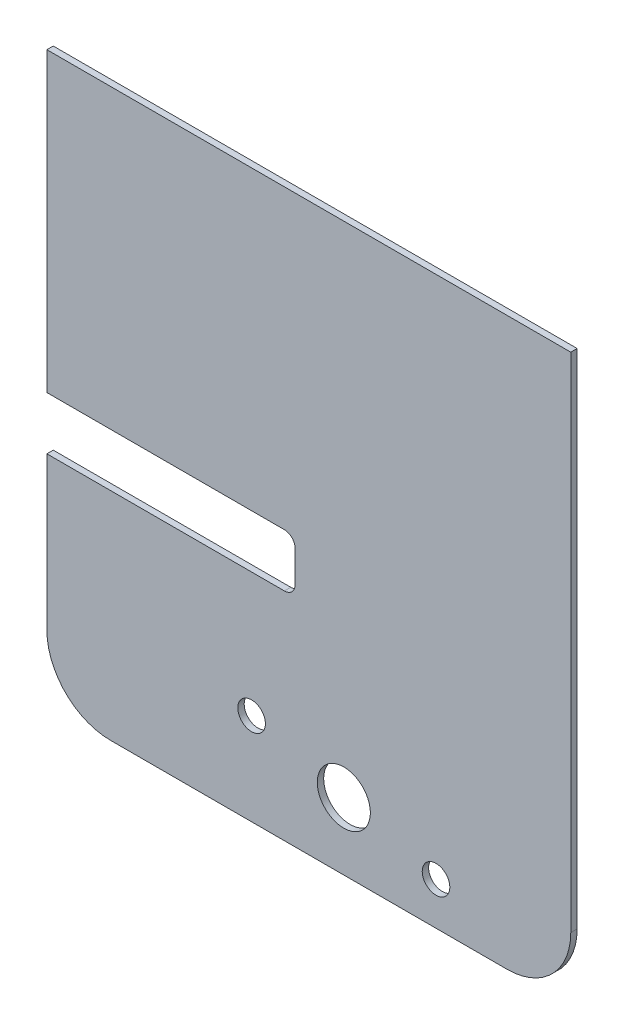
ISO-10303-21;
HEADER;
FILE_DESCRIPTION(('STEP AP214'),'2;1');
FILE_NAME('part.step','',(''),(''),'','','');
FILE_SCHEMA(('AUTOMOTIVE_DESIGN { 1 0 10303 214 1 1 1 1 }'));
ENDSEC;
DATA;
#1=APPLICATION_CONTEXT('core data for automotive mechanical design processes');
#2=APPLICATION_PROTOCOL_DEFINITION('international standard','automotive_design',2000,#1);
#3=PRODUCT_CONTEXT('',#1,'mechanical');
#4=PRODUCT('Part','Part','',(#3));
#5=PRODUCT_RELATED_PRODUCT_CATEGORY('part','',(#4));
#6=PRODUCT_DEFINITION_FORMATION('','',#4);
#7=PRODUCT_DEFINITION_CONTEXT('part definition',#1,'design');
#8=PRODUCT_DEFINITION('design','',#6,#7);
#9=PRODUCT_DEFINITION_SHAPE('','',#8);
#10=(LENGTH_UNIT() NAMED_UNIT(*) SI_UNIT(.MILLI.,.METRE.));
#11=(NAMED_UNIT(*) PLANE_ANGLE_UNIT() SI_UNIT($,.RADIAN.));
#12=(NAMED_UNIT(*) SI_UNIT($,.STERADIAN.) SOLID_ANGLE_UNIT());
#13=UNCERTAINTY_MEASURE_WITH_UNIT(LENGTH_MEASURE(1.E-05),#10,'distance_accuracy_value','');
#14=(GEOMETRIC_REPRESENTATION_CONTEXT(3) GLOBAL_UNCERTAINTY_ASSIGNED_CONTEXT((#13)) GLOBAL_UNIT_ASSIGNED_CONTEXT((#10,
#11,#12)) REPRESENTATION_CONTEXT('',''));
#15=CARTESIAN_POINT('',(0.,0.,0.));
#16=DIRECTION('',(0.,0.,1.));
#17=DIRECTION('',(1.,0.,0.));
#18=AXIS2_PLACEMENT_3D('',#15,#16,#17);
#19=CARTESIAN_POINT('',(-123.5,-133.5,3.));
#20=DIRECTION('',(1.,0.,0.));
#21=DIRECTION('',(0.,0.,-1.));
#22=AXIS2_PLACEMENT_3D('',#19,#20,#21);
#23=PLANE('',#22);
#24=DIRECTION('',(0.,-1.,0.));
#25=VECTOR('',#24,1.);
#26=CARTESIAN_POINT('',(-123.5,-133.5,0.));
#27=LINE('',#26,#25);
#28=CARTESIAN_POINT('',(-123.5,-31.49999999999,0.));
#29=VERTEX_POINT('',#28);
#30=CARTESIAN_POINT('',(-123.5,-103.5,0.));
#31=VERTEX_POINT('',#30);
#32=EDGE_CURVE('E156',#29,#31,#27,.T.);
#33=ORIENTED_EDGE('',*,*,#32,.T.);
#34=DIRECTION('',(0.,0.,-1.));
#35=VECTOR('',#34,1.);
#36=CARTESIAN_POINT('',(-123.5,-103.5,3.));
#37=LINE('',#36,#35);
#38=CARTESIAN_POINT('',(-123.5,-103.5,3.));
#39=VERTEX_POINT('',#38);
#40=EDGE_CURVE('E177',#31,#39,#37,.F.);
#41=ORIENTED_EDGE('',*,*,#40,.T.);
#42=DIRECTION('',(0.,-1.,0.));
#43=VECTOR('',#42,1.);
#44=CARTESIAN_POINT('',(-123.5,-133.5,3.));
#45=LINE('',#44,#43);
#46=CARTESIAN_POINT('',(-123.5,-31.49999999999,3.));
#47=VERTEX_POINT('',#46);
#48=EDGE_CURVE('E143',#47,#39,#45,.T.);
#49=ORIENTED_EDGE('',*,*,#48,.F.);
#50=DIRECTION('',(0.,0.,-1.));
#51=VECTOR('',#50,1.);
#52=CARTESIAN_POINT('',(-123.5,-31.49999999999,3.));
#53=LINE('',#52,#51);
#54=EDGE_CURVE('E211',#47,#29,#53,.T.);
#55=ORIENTED_EDGE('',*,*,#54,.T.);
#56=EDGE_LOOP('',(#33,#41,#49,#55));
#57=FACE_BOUND('',#56,.T.);
#58=ADVANCED_FACE('F33',(#57),#23,.F.);
#59=CARTESIAN_POINT('',(123.5,-133.5,3.));
#60=DIRECTION('',(-1.,0.,0.));
#61=DIRECTION('',(0.,0.,1.));
#62=AXIS2_PLACEMENT_3D('',#59,#60,#61);
#63=PLANE('',#62);
#64=DIRECTION('',(0.,1.,0.));
#65=VECTOR('',#64,1.);
#66=CARTESIAN_POINT('',(123.5,-133.5,3.));
#67=LINE('',#66,#65);
#68=CARTESIAN_POINT('',(123.5,-103.5,3.));
#69=VERTEX_POINT('',#68);
#70=CARTESIAN_POINT('',(123.5,133.5,3.));
#71=VERTEX_POINT('',#70);
#72=EDGE_CURVE('E161',#69,#71,#67,.T.);
#73=ORIENTED_EDGE('',*,*,#72,.F.);
#74=DIRECTION('',(0.,0.,-1.));
#75=VECTOR('',#74,1.);
#76=CARTESIAN_POINT('',(123.5,-103.5,3.));
#77=LINE('',#76,#75);
#78=CARTESIAN_POINT('',(123.5,-103.5,0.));
#79=VERTEX_POINT('',#78);
#80=EDGE_CURVE('E183',#69,#79,#77,.T.);
#81=ORIENTED_EDGE('',*,*,#80,.T.);
#82=DIRECTION('',(0.,1.,0.));
#83=VECTOR('',#82,1.);
#84=CARTESIAN_POINT('',(123.5,-133.5,0.));
#85=LINE('',#84,#83);
#86=CARTESIAN_POINT('',(123.5,133.5,0.));
#87=VERTEX_POINT('',#86);
#88=EDGE_CURVE('E151',#79,#87,#85,.T.);
#89=ORIENTED_EDGE('',*,*,#88,.T.);
#90=DIRECTION('',(0.,0.,-1.));
#91=VECTOR('',#90,1.);
#92=CARTESIAN_POINT('',(123.5,133.5,3.));
#93=LINE('',#92,#91);
#94=EDGE_CURVE('E163',#71,#87,#93,.T.);
#95=ORIENTED_EDGE('',*,*,#94,.F.);
#96=EDGE_LOOP('',(#73,#81,#89,#95));
#97=FACE_BOUND('',#96,.T.);
#98=ADVANCED_FACE('F252',(#97),#63,.F.);
#99=CARTESIAN_POINT('',(-123.5,133.5,3.));
#100=DIRECTION('',(0.,-1.,0.));
#101=DIRECTION('',(0.,0.,-1.));
#102=AXIS2_PLACEMENT_3D('',#99,#100,#101);
#103=PLANE('',#102);
#104=DIRECTION('',(-1.,0.,0.));
#105=VECTOR('',#104,1.);
#106=CARTESIAN_POINT('',(-123.5,133.5,0.));
#107=LINE('',#106,#105);
#108=CARTESIAN_POINT('',(-123.5,133.5,0.));
#109=VERTEX_POINT('',#108);
#110=EDGE_CURVE('E153',#87,#109,#107,.T.);
#111=ORIENTED_EDGE('',*,*,#110,.T.);
#112=DIRECTION('',(0.,0.,-1.));
#113=VECTOR('',#112,1.);
#114=CARTESIAN_POINT('',(-123.5,133.5,3.));
#115=LINE('',#114,#113);
#116=CARTESIAN_POINT('',(-123.5,133.5,3.));
#117=VERTEX_POINT('',#116);
#118=EDGE_CURVE('E146',#117,#109,#115,.T.);
#119=ORIENTED_EDGE('',*,*,#118,.F.);
#120=DIRECTION('',(-1.,0.,0.));
#121=VECTOR('',#120,1.);
#122=CARTESIAN_POINT('',(-123.5,133.5,3.));
#123=LINE('',#122,#121);
#124=EDGE_CURVE('E140',#71,#117,#123,.T.);
#125=ORIENTED_EDGE('',*,*,#124,.F.);
#126=ORIENTED_EDGE('',*,*,#94,.T.);
#127=EDGE_LOOP('',(#111,#119,#125,#126));
#128=FACE_BOUND('',#127,.T.);
#129=ADVANCED_FACE('F251',(#128),#103,.F.);
#130=CARTESIAN_POINT('',(-123.5,-6.49999999998996,0.));
#131=VERTEX_POINT('',#130);
#132=EDGE_CURVE('E134',#109,#131,#27,.T.);
#133=ORIENTED_EDGE('',*,*,#132,.T.);
#134=DIRECTION('',(0.,0.,1.));
#135=VECTOR('',#134,1.);
#136=CARTESIAN_POINT('',(-123.5,-6.49999999998996,3.));
#137=LINE('',#136,#135);
#138=CARTESIAN_POINT('',(-123.5,-6.49999999998996,3.));
#139=VERTEX_POINT('',#138);
#140=EDGE_CURVE('E121',#131,#139,#137,.T.);
#141=ORIENTED_EDGE('',*,*,#140,.T.);
#142=EDGE_CURVE('E132',#117,#139,#45,.T.);
#143=ORIENTED_EDGE('',*,*,#142,.F.);
#144=ORIENTED_EDGE('',*,*,#118,.T.);
#145=EDGE_LOOP('',(#133,#141,#143,#144));
#146=FACE_BOUND('',#145,.T.);
#147=ADVANCED_FACE('F130',(#146),#23,.F.);
#148=CARTESIAN_POINT('',(-123.5,-133.5,3.));
#149=DIRECTION('',(0.,1.,0.));
#150=DIRECTION('',(0.,0.,1.));
#151=AXIS2_PLACEMENT_3D('',#148,#149,#150);
#152=PLANE('',#151);
#153=DIRECTION('',(1.,0.,0.));
#154=VECTOR('',#153,1.);
#155=CARTESIAN_POINT('',(-123.5,-133.5,3.));
#156=LINE('',#155,#154);
#157=CARTESIAN_POINT('',(-93.4999999999999,-133.5,3.));
#158=VERTEX_POINT('',#157);
#159=CARTESIAN_POINT('',(93.5000000000001,-133.5,3.));
#160=VERTEX_POINT('',#159);
#161=EDGE_CURVE('E142',#158,#160,#156,.T.);
#162=ORIENTED_EDGE('',*,*,#161,.F.);
#163=DIRECTION('',(0.,0.,-1.));
#164=VECTOR('',#163,1.);
#165=CARTESIAN_POINT('',(-93.4999999999999,-133.5,3.));
#166=LINE('',#165,#164);
#167=CARTESIAN_POINT('',(-93.4999999999999,-133.5,0.));
#168=VERTEX_POINT('',#167);
#169=EDGE_CURVE('E170',#158,#168,#166,.T.);
#170=ORIENTED_EDGE('',*,*,#169,.T.);
#171=DIRECTION('',(1.,0.,0.));
#172=VECTOR('',#171,1.);
#173=CARTESIAN_POINT('',(-123.5,-133.5,0.));
#174=LINE('',#173,#172);
#175=CARTESIAN_POINT('',(93.5000000000001,-133.5,0.));
#176=VERTEX_POINT('',#175);
#177=EDGE_CURVE('E158',#168,#176,#174,.T.);
#178=ORIENTED_EDGE('',*,*,#177,.T.);
#179=DIRECTION('',(0.,0.,-1.));
#180=VECTOR('',#179,1.);
#181=CARTESIAN_POINT('',(93.5000000000001,-133.5,3.));
#182=LINE('',#181,#180);
#183=EDGE_CURVE('E168',#176,#160,#182,.F.);
#184=ORIENTED_EDGE('',*,*,#183,.T.);
#185=EDGE_LOOP('',(#162,#170,#178,#184));
#186=FACE_BOUND('',#185,.T.);
#187=ADVANCED_FACE('F272',(#186),#152,.F.);
#188=CARTESIAN_POINT('',(0.,0.,3.));
#189=DIRECTION('',(0.,0.,-1.));
#190=DIRECTION('',(-1.,0.,0.));
#191=AXIS2_PLACEMENT_3D('',#188,#189,#190);
#192=PLANE('',#191);
#193=CARTESIAN_POINT('',(59.9666621830082,-113.5,3.));
#194=DIRECTION('',(0.,0.,-1.));
#195=DIRECTION('',(-1.,0.,0.));
#196=AXIS2_PLACEMENT_3D('',#193,#194,#195);
#197=CIRCLE('',#196,6.50000000000002);
#198=CARTESIAN_POINT('',(53.4666621830082,-113.5,3.));
#199=VERTEX_POINT('',#198);
#200=EDGE_CURVE('E154',#199,#199,#197,.T.);
#201=ORIENTED_EDGE('',*,*,#200,.T.);
#202=EDGE_LOOP('',(#201));
#203=FACE_BOUND('',#202,.T.);
#204=CARTESIAN_POINT('',(16.5000000000001,-101.853142970387,3.));
#205=DIRECTION('',(0.,0.,-1.));
#206=DIRECTION('',(-1.,0.,0.));
#207=AXIS2_PLACEMENT_3D('',#204,#205,#206);
#208=CIRCLE('',#207,12.5);
#209=CARTESIAN_POINT('',(4.00000000000009,-101.853142970387,3.));
#210=VERTEX_POINT('',#209);
#211=EDGE_CURVE('E235',#210,#210,#208,.T.);
#212=ORIENTED_EDGE('',*,*,#211,.T.);
#213=EDGE_LOOP('',(#212));
#214=FACE_BOUND('',#213,.T.);
#215=CARTESIAN_POINT('',(-26.9666621830081,-90.2062859407736,3.));
#216=DIRECTION('',(0.,0.,-1.));
#217=DIRECTION('',(-1.,0.,0.));
#218=AXIS2_PLACEMENT_3D('',#215,#216,#217);
#219=CIRCLE('',#218,6.50000000000002);
#220=CARTESIAN_POINT('',(-33.4666621830081,-90.2062859407736,3.));
#221=VERTEX_POINT('',#220);
#222=EDGE_CURVE('E241',#221,#221,#219,.T.);
#223=ORIENTED_EDGE('',*,*,#222,.T.);
#224=EDGE_LOOP('',(#223));
#225=FACE_BOUND('',#224,.T.);
#226=ORIENTED_EDGE('',*,*,#48,.T.);
#227=CARTESIAN_POINT('',(-93.4999999999999,-103.5,3.));
#228=DIRECTION('',(0.,0.,-1.));
#229=DIRECTION('',(-1.,0.,0.));
#230=AXIS2_PLACEMENT_3D('',#227,#228,#229);
#231=CIRCLE('',#230,30.);
#232=EDGE_CURVE('E181',#39,#158,#231,.F.);
#233=ORIENTED_EDGE('',*,*,#232,.T.);
#234=ORIENTED_EDGE('',*,*,#161,.T.);
#235=CARTESIAN_POINT('',(93.5000000000001,-103.5,3.));
#236=DIRECTION('',(0.,0.,-1.));
#237=DIRECTION('',(-1.,0.,0.));
#238=AXIS2_PLACEMENT_3D('',#235,#236,#237);
#239=CIRCLE('',#238,30.);
#240=EDGE_CURVE('E179',#160,#69,#239,.F.);
#241=ORIENTED_EDGE('',*,*,#240,.T.);
#242=ORIENTED_EDGE('',*,*,#72,.T.);
#243=ORIENTED_EDGE('',*,*,#124,.T.);
#244=ORIENTED_EDGE('',*,*,#142,.T.);
#245=DIRECTION('',(1.,0.,0.));
#246=VECTOR('',#245,1.);
#247=CARTESIAN_POINT('',(0.,-6.49999999998998,3.));
#248=LINE('',#247,#246);
#249=CARTESIAN_POINT('',(-11.4999999999977,-6.49999999998998,3.));
#250=VERTEX_POINT('',#249);
#251=EDGE_CURVE('E118',#139,#250,#248,.T.);
#252=ORIENTED_EDGE('',*,*,#251,.T.);
#253=CARTESIAN_POINT('',(-11.4999999999977,-11.49999999999,3.));
#254=DIRECTION('',(0.,0.,-1.));
#255=DIRECTION('',(-1.,0.,0.));
#256=AXIS2_PLACEMENT_3D('',#253,#254,#255);
#257=CIRCLE('',#256,5.);
#258=CARTESIAN_POINT('',(-6.49999999999773,-11.49999999999,3.));
#259=VERTEX_POINT('',#258);
#260=EDGE_CURVE('E11',#250,#259,#257,.T.);
#261=ORIENTED_EDGE('',*,*,#260,.T.);
#262=DIRECTION('',(0.,-1.,0.));
#263=VECTOR('',#262,1.);
#264=CARTESIAN_POINT('',(-6.49999999999773,0.,3.));
#265=LINE('',#264,#263);
#266=CARTESIAN_POINT('',(-6.49999999999773,-26.49999999999,3.));
#267=VERTEX_POINT('',#266);
#268=EDGE_CURVE('E135',#259,#267,#265,.T.);
#269=ORIENTED_EDGE('',*,*,#268,.T.);
#270=CARTESIAN_POINT('',(-11.4999999999977,-26.49999999999,3.));
#271=DIRECTION('',(0.,0.,-1.));
#272=DIRECTION('',(-1.,0.,0.));
#273=AXIS2_PLACEMENT_3D('',#270,#271,#272);
#274=CIRCLE('',#273,5.);
#275=CARTESIAN_POINT('',(-11.4999999999977,-31.49999999999,3.));
#276=VERTEX_POINT('',#275);
#277=EDGE_CURVE('E197',#267,#276,#274,.T.);
#278=ORIENTED_EDGE('',*,*,#277,.T.);
#279=DIRECTION('',(-1.,0.,0.));
#280=VECTOR('',#279,1.);
#281=CARTESIAN_POINT('',(0.,-31.49999999999,3.));
#282=LINE('',#281,#280);
#283=EDGE_CURVE('E201',#276,#47,#282,.T.);
#284=ORIENTED_EDGE('',*,*,#283,.T.);
#285=EDGE_LOOP('',(#226,#233,#234,#241,#242,#243,#244,#252,#261,#269,#278,#284));
#286=FACE_BOUND('',#285,.T.);
#287=ADVANCED_FACE('F138',(#203,#214,#225,#286),#192,.F.);
#288=CARTESIAN_POINT('',(0.,0.,0.));
#289=DIRECTION('',(0.,0.,-1.));
#290=DIRECTION('',(-1.,0.,0.));
#291=AXIS2_PLACEMENT_3D('',#288,#289,#290);
#292=PLANE('',#291);
#293=ORIENTED_EDGE('',*,*,#177,.F.);
#294=CARTESIAN_POINT('',(-93.4999999999999,-103.5,0.));
#295=DIRECTION('',(0.,0.,-1.));
#296=DIRECTION('',(-1.,0.,0.));
#297=AXIS2_PLACEMENT_3D('',#294,#295,#296);
#298=CIRCLE('',#297,30.);
#299=EDGE_CURVE('E175',#168,#31,#298,.T.);
#300=ORIENTED_EDGE('',*,*,#299,.T.);
#301=ORIENTED_EDGE('',*,*,#32,.F.);
#302=DIRECTION('',(-1.,0.,0.));
#303=VECTOR('',#302,1.);
#304=CARTESIAN_POINT('',(-126.499999999998,-31.49999999999,0.));
#305=LINE('',#304,#303);
#306=CARTESIAN_POINT('',(-11.4999999999977,-31.49999999999,0.));
#307=VERTEX_POINT('',#306);
#308=EDGE_CURVE('E125',#307,#29,#305,.T.);
#309=ORIENTED_EDGE('',*,*,#308,.F.);
#310=CARTESIAN_POINT('',(-11.4999999999977,-26.49999999999,0.));
#311=DIRECTION('',(0.,0.,-1.));
#312=DIRECTION('',(-1.,0.,0.));
#313=AXIS2_PLACEMENT_3D('',#310,#311,#312);
#314=CIRCLE('',#313,5.);
#315=CARTESIAN_POINT('',(-6.49999999999773,-26.49999999999,0.));
#316=VERTEX_POINT('',#315);
#317=EDGE_CURVE('E195',#307,#316,#314,.F.);
#318=ORIENTED_EDGE('',*,*,#317,.T.);
#319=DIRECTION('',(0.,-1.,0.));
#320=VECTOR('',#319,1.);
#321=CARTESIAN_POINT('',(-6.49999999999773,-31.49999999999,0.));
#322=LINE('',#321,#320);
#323=CARTESIAN_POINT('',(-6.49999999999773,-11.49999999999,0.));
#324=VERTEX_POINT('',#323);
#325=EDGE_CURVE('E219',#324,#316,#322,.T.);
#326=ORIENTED_EDGE('',*,*,#325,.F.);
#327=CARTESIAN_POINT('',(-11.4999999999977,-11.49999999999,0.));
#328=DIRECTION('',(0.,0.,-1.));
#329=DIRECTION('',(-1.,0.,0.));
#330=AXIS2_PLACEMENT_3D('',#327,#328,#329);
#331=CIRCLE('',#330,5.);
#332=CARTESIAN_POINT('',(-11.4999999999977,-6.49999999998998,0.));
#333=VERTEX_POINT('',#332);
#334=EDGE_CURVE('E41',#324,#333,#331,.F.);
#335=ORIENTED_EDGE('',*,*,#334,.T.);
#336=DIRECTION('',(1.,0.,0.));
#337=VECTOR('',#336,1.);
#338=CARTESIAN_POINT('',(0.,-6.49999999998998,0.));
#339=LINE('',#338,#337);
#340=EDGE_CURVE('E166',#131,#333,#339,.T.);
#341=ORIENTED_EDGE('',*,*,#340,.F.);
#342=ORIENTED_EDGE('',*,*,#132,.F.);
#343=ORIENTED_EDGE('',*,*,#110,.F.);
#344=ORIENTED_EDGE('',*,*,#88,.F.);
#345=CARTESIAN_POINT('',(93.5000000000001,-103.5,0.));
#346=DIRECTION('',(0.,0.,-1.));
#347=DIRECTION('',(-1.,0.,0.));
#348=AXIS2_PLACEMENT_3D('',#345,#346,#347);
#349=CIRCLE('',#348,30.);
#350=EDGE_CURVE('E173',#79,#176,#349,.T.);
#351=ORIENTED_EDGE('',*,*,#350,.T.);
#352=EDGE_LOOP('',(#293,#300,#301,#309,#318,#326,#335,#341,#342,#343,#344,#351));
#353=FACE_BOUND('',#352,.T.);
#354=CARTESIAN_POINT('',(59.9666621830082,-113.5,0.));
#355=DIRECTION('',(0.,0.,-1.));
#356=DIRECTION('',(-1.,0.,0.));
#357=AXIS2_PLACEMENT_3D('',#354,#355,#356);
#358=CIRCLE('',#357,6.50000000000002);
#359=CARTESIAN_POINT('',(53.4666621830082,-113.5,0.));
#360=VERTEX_POINT('',#359);
#361=EDGE_CURVE('E232',#360,#360,#358,.T.);
#362=ORIENTED_EDGE('',*,*,#361,.F.);
#363=EDGE_LOOP('',(#362));
#364=FACE_BOUND('',#363,.T.);
#365=CARTESIAN_POINT('',(16.5000000000001,-101.853142970387,0.));
#366=DIRECTION('',(0.,0.,-1.));
#367=DIRECTION('',(-1.,0.,0.));
#368=AXIS2_PLACEMENT_3D('',#365,#366,#367);
#369=CIRCLE('',#368,12.5);
#370=CARTESIAN_POINT('',(4.00000000000009,-101.853142970387,0.));
#371=VERTEX_POINT('',#370);
#372=EDGE_CURVE('E238',#371,#371,#369,.T.);
#373=ORIENTED_EDGE('',*,*,#372,.F.);
#374=EDGE_LOOP('',(#373));
#375=FACE_BOUND('',#374,.T.);
#376=CARTESIAN_POINT('',(-26.9666621830081,-90.2062859407736,0.));
#377=DIRECTION('',(0.,0.,-1.));
#378=DIRECTION('',(-1.,0.,0.));
#379=AXIS2_PLACEMENT_3D('',#376,#377,#378);
#380=CIRCLE('',#379,6.50000000000002);
#381=CARTESIAN_POINT('',(-33.4666621830081,-90.2062859407736,0.));
#382=VERTEX_POINT('',#381);
#383=EDGE_CURVE('E229',#382,#382,#380,.T.);
#384=ORIENTED_EDGE('',*,*,#383,.F.);
#385=EDGE_LOOP('',(#384));
#386=FACE_BOUND('',#385,.T.);
#387=ADVANCED_FACE('F217',(#353,#364,#375,#386),#292,.T.);
#388=CARTESIAN_POINT('',(-26.9666621830081,-90.2062859407736,3.));
#389=DIRECTION('',(0.,0.,-1.));
#390=DIRECTION('',(-1.,0.,0.));
#391=AXIS2_PLACEMENT_3D('',#388,#389,#390);
#392=CYLINDRICAL_SURFACE('',#391,6.50000000000002);
#393=ORIENTED_EDGE('',*,*,#222,.F.);
#394=EDGE_LOOP('',(#393));
#395=FACE_BOUND('',#394,.T.);
#396=ORIENTED_EDGE('',*,*,#383,.T.);
#397=EDGE_LOOP('',(#396));
#398=FACE_BOUND('',#397,.T.);
#399=ADVANCED_FACE('F341',(#395,#398),#392,.F.);
#400=CARTESIAN_POINT('',(16.5000000000001,-101.853142970387,3.));
#401=DIRECTION('',(0.,0.,-1.));
#402=DIRECTION('',(-1.,0.,0.));
#403=AXIS2_PLACEMENT_3D('',#400,#401,#402);
#404=CYLINDRICAL_SURFACE('',#403,12.5);
#405=ORIENTED_EDGE('',*,*,#211,.F.);
#406=EDGE_LOOP('',(#405));
#407=FACE_BOUND('',#406,.T.);
#408=ORIENTED_EDGE('',*,*,#372,.T.);
#409=EDGE_LOOP('',(#408));
#410=FACE_BOUND('',#409,.T.);
#411=ADVANCED_FACE('F385',(#407,#410),#404,.F.);
#412=CARTESIAN_POINT('',(59.9666621830082,-113.5,3.));
#413=DIRECTION('',(0.,0.,-1.));
#414=DIRECTION('',(-1.,0.,0.));
#415=AXIS2_PLACEMENT_3D('',#412,#413,#414);
#416=CYLINDRICAL_SURFACE('',#415,6.50000000000002);
#417=ORIENTED_EDGE('',*,*,#200,.F.);
#418=EDGE_LOOP('',(#417));
#419=FACE_BOUND('',#418,.T.);
#420=ORIENTED_EDGE('',*,*,#361,.T.);
#421=EDGE_LOOP('',(#420));
#422=FACE_BOUND('',#421,.T.);
#423=ADVANCED_FACE('F331',(#419,#422),#416,.F.);
#424=CARTESIAN_POINT('',(-126.499999999998,-31.49999999999,10.));
#425=DIRECTION('',(0.,-1.,0.));
#426=DIRECTION('',(1.,0.,0.));
#427=AXIS2_PLACEMENT_3D('',#424,#425,#426);
#428=PLANE('',#427);
#429=ORIENTED_EDGE('',*,*,#283,.F.);
#430=DIRECTION('',(0.,0.,-1.));
#431=VECTOR('',#430,1.);
#432=CARTESIAN_POINT('',(-11.4999999999977,-31.49999999999,0.));
#433=LINE('',#432,#431);
#434=EDGE_CURVE('E186',#276,#307,#433,.T.);
#435=ORIENTED_EDGE('',*,*,#434,.T.);
#436=ORIENTED_EDGE('',*,*,#308,.T.);
#437=ORIENTED_EDGE('',*,*,#54,.F.);
#438=EDGE_LOOP('',(#429,#435,#436,#437));
#439=FACE_BOUND('',#438,.T.);
#440=ADVANCED_FACE('F208',(#439),#428,.F.);
#441=CARTESIAN_POINT('',(-6.49999999999773,-31.49999999999,10.));
#442=DIRECTION('',(1.,0.,0.));
#443=DIRECTION('',(0.,0.,-1.));
#444=AXIS2_PLACEMENT_3D('',#441,#442,#443);
#445=PLANE('',#444);
#446=ORIENTED_EDGE('',*,*,#325,.T.);
#447=DIRECTION('',(0.,0.,-1.));
#448=VECTOR('',#447,1.);
#449=CARTESIAN_POINT('',(-6.49999999999773,-26.49999999999,3.));
#450=LINE('',#449,#448);
#451=EDGE_CURVE('E192',#316,#267,#450,.F.);
#452=ORIENTED_EDGE('',*,*,#451,.T.);
#453=ORIENTED_EDGE('',*,*,#268,.F.);
#454=DIRECTION('',(0.,0.,-1.));
#455=VECTOR('',#454,1.);
#456=CARTESIAN_POINT('',(-6.49999999999773,-11.49999999999,0.));
#457=LINE('',#456,#455);
#458=EDGE_CURVE('E189',#259,#324,#457,.T.);
#459=ORIENTED_EDGE('',*,*,#458,.T.);
#460=EDGE_LOOP('',(#446,#452,#453,#459));
#461=FACE_BOUND('',#460,.T.);
#462=ADVANCED_FACE('F222',(#461),#445,.F.);
#463=CARTESIAN_POINT('',(-126.499999999998,-6.49999999998996,10.));
#464=DIRECTION('',(0.,1.,0.));
#465=DIRECTION('',(-1.,0.,0.));
#466=AXIS2_PLACEMENT_3D('',#463,#464,#465);
#467=PLANE('',#466);
#468=ORIENTED_EDGE('',*,*,#340,.T.);
#469=DIRECTION('',(0.,0.,-1.));
#470=VECTOR('',#469,1.);
#471=CARTESIAN_POINT('',(-11.4999999999977,-6.49999999998998,3.));
#472=LINE('',#471,#470);
#473=EDGE_CURVE('E48',#333,#250,#472,.F.);
#474=ORIENTED_EDGE('',*,*,#473,.T.);
#475=ORIENTED_EDGE('',*,*,#251,.F.);
#476=ORIENTED_EDGE('',*,*,#140,.F.);
#477=EDGE_LOOP('',(#468,#474,#475,#476));
#478=FACE_BOUND('',#477,.T.);
#479=ADVANCED_FACE('F120',(#478),#467,.F.);
#480=CARTESIAN_POINT('',(-93.4999999999999,-103.5,3.));
#481=DIRECTION('',(0.,0.,-1.));
#482=DIRECTION('',(-1.,0.,0.));
#483=AXIS2_PLACEMENT_3D('',#480,#481,#482);
#484=CYLINDRICAL_SURFACE('',#483,30.);
#485=ORIENTED_EDGE('',*,*,#232,.F.);
#486=ORIENTED_EDGE('',*,*,#40,.F.);
#487=ORIENTED_EDGE('',*,*,#299,.F.);
#488=ORIENTED_EDGE('',*,*,#169,.F.);
#489=EDGE_LOOP('',(#485,#486,#487,#488));
#490=FACE_BOUND('',#489,.T.);
#491=ADVANCED_FACE('F281',(#490),#484,.T.);
#492=CARTESIAN_POINT('',(93.5000000000001,-103.5,3.));
#493=DIRECTION('',(0.,0.,-1.));
#494=DIRECTION('',(-1.,0.,0.));
#495=AXIS2_PLACEMENT_3D('',#492,#493,#494);
#496=CYLINDRICAL_SURFACE('',#495,30.);
#497=ORIENTED_EDGE('',*,*,#240,.F.);
#498=ORIENTED_EDGE('',*,*,#183,.F.);
#499=ORIENTED_EDGE('',*,*,#350,.F.);
#500=ORIENTED_EDGE('',*,*,#80,.F.);
#501=EDGE_LOOP('',(#497,#498,#499,#500));
#502=FACE_BOUND('',#501,.T.);
#503=ADVANCED_FACE('F260',(#502),#496,.T.);
#504=CARTESIAN_POINT('',(-11.4999999999977,-26.49999999999,10.));
#505=DIRECTION('',(0.,0.,1.));
#506=DIRECTION('',(1.,0.,0.));
#507=AXIS2_PLACEMENT_3D('',#504,#505,#506);
#508=CYLINDRICAL_SURFACE('',#507,5.);
#509=ORIENTED_EDGE('',*,*,#277,.F.);
#510=ORIENTED_EDGE('',*,*,#451,.F.);
#511=ORIENTED_EDGE('',*,*,#317,.F.);
#512=ORIENTED_EDGE('',*,*,#434,.F.);
#513=EDGE_LOOP('',(#509,#510,#511,#512));
#514=FACE_BOUND('',#513,.T.);
#515=ADVANCED_FACE('F214',(#514),#508,.F.);
#516=CARTESIAN_POINT('',(-11.4999999999977,-11.49999999999,10.));
#517=DIRECTION('',(0.,0.,1.));
#518=DIRECTION('',(1.,0.,0.));
#519=AXIS2_PLACEMENT_3D('',#516,#517,#518);
#520=CYLINDRICAL_SURFACE('',#519,5.);
#521=ORIENTED_EDGE('',*,*,#260,.F.);
#522=ORIENTED_EDGE('',*,*,#473,.F.);
#523=ORIENTED_EDGE('',*,*,#334,.F.);
#524=ORIENTED_EDGE('',*,*,#458,.F.);
#525=EDGE_LOOP('',(#521,#522,#523,#524));
#526=FACE_BOUND('',#525,.T.);
#527=ADVANCED_FACE('F35',(#526),#520,.F.);
#528=CLOSED_SHELL('',(#58,#98,#129,#147,#187,#287,#387,#399,#411,#423,#440,#462,#479,#491,#503,
#515,#527));
#529=MANIFOLD_SOLID_BREP('B2',#528);
#530=ADVANCED_BREP_SHAPE_REPRESENTATION('',(#18,#529),#14);
#531=SHAPE_DEFINITION_REPRESENTATION(#9,#530);
ENDSEC;
END-ISO-10303-21;
